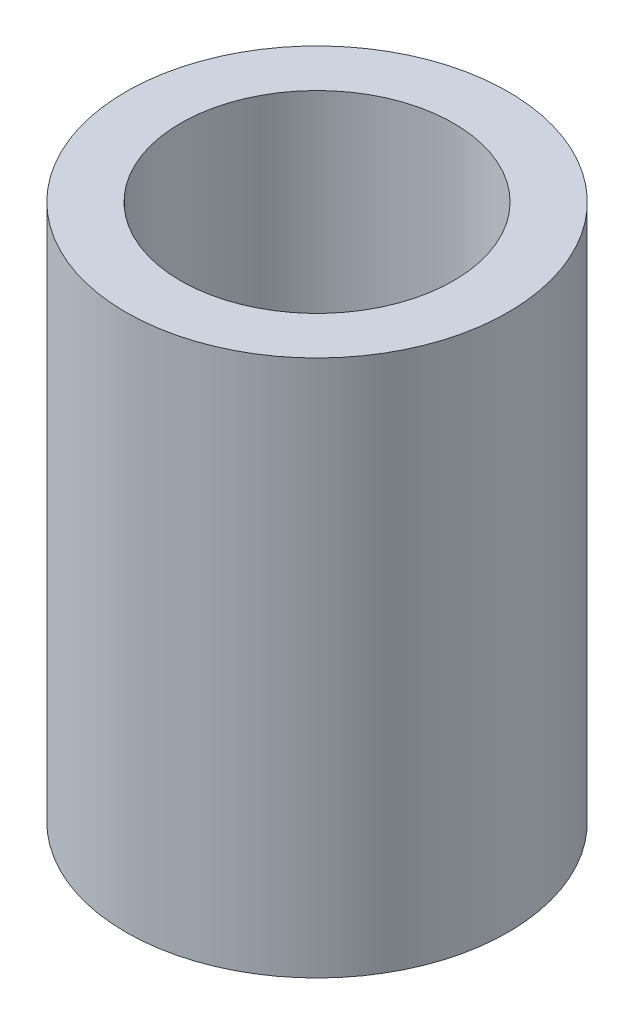
ISO-10303-21;
HEADER;
FILE_DESCRIPTION(('STEP AP214'),'2;1');
FILE_NAME('part.step','',(''),(''),'','','');
FILE_SCHEMA(('AUTOMOTIVE_DESIGN { 1 0 10303 214 1 1 1 1 }'));
ENDSEC;
DATA;
#1=APPLICATION_CONTEXT('core data for automotive mechanical design processes');
#2=APPLICATION_PROTOCOL_DEFINITION('international standard','automotive_design',2000,#1);
#3=PRODUCT_CONTEXT('',#1,'mechanical');
#4=PRODUCT('Part','Part','',(#3));
#5=PRODUCT_RELATED_PRODUCT_CATEGORY('part','',(#4));
#6=PRODUCT_DEFINITION_FORMATION('','',#4);
#7=PRODUCT_DEFINITION_CONTEXT('part definition',#1,'design');
#8=PRODUCT_DEFINITION('design','',#6,#7);
#9=PRODUCT_DEFINITION_SHAPE('','',#8);
#10=(LENGTH_UNIT() NAMED_UNIT(*) SI_UNIT(.MILLI.,.METRE.));
#11=(NAMED_UNIT(*) PLANE_ANGLE_UNIT() SI_UNIT($,.RADIAN.));
#12=(NAMED_UNIT(*) SI_UNIT($,.STERADIAN.) SOLID_ANGLE_UNIT());
#13=UNCERTAINTY_MEASURE_WITH_UNIT(LENGTH_MEASURE(1.E-05),#10,'distance_accuracy_value','');
#14=(GEOMETRIC_REPRESENTATION_CONTEXT(3) GLOBAL_UNCERTAINTY_ASSIGNED_CONTEXT((#13)) GLOBAL_UNIT_ASSIGNED_CONTEXT((#10,
#11,#12)) REPRESENTATION_CONTEXT('',''));
#15=CARTESIAN_POINT('',(0.,0.,0.));
#16=DIRECTION('',(0.,0.,1.));
#17=DIRECTION('',(1.,0.,0.));
#18=AXIS2_PLACEMENT_3D('',#15,#16,#17);
#19=CARTESIAN_POINT('',(0.,5.9,0.));
#20=DIRECTION('',(0.,1.,0.));
#21=DIRECTION('',(0.,0.,1.));
#22=AXIS2_PLACEMENT_3D('',#19,#20,#21);
#23=PLANE('',#22);
#24=CARTESIAN_POINT('',(0.,5.9,0.));
#25=DIRECTION('',(0.,1.,0.));
#26=DIRECTION('',(0.,0.,1.));
#27=AXIS2_PLACEMENT_3D('',#24,#25,#26);
#28=CIRCLE('',#27,2.1);
#29=CARTESIAN_POINT('',(0.,5.9,2.1));
#30=VERTEX_POINT('',#29);
#31=EDGE_CURVE('E10',#30,#30,#28,.T.);
#32=ORIENTED_EDGE('',*,*,#31,.T.);
#33=EDGE_LOOP('',(#32));
#34=FACE_BOUND('',#33,.T.);
#35=CARTESIAN_POINT('',(0.,5.9,0.));
#36=DIRECTION('',(0.,1.,0.));
#37=DIRECTION('',(0.,0.,1.));
#38=AXIS2_PLACEMENT_3D('',#35,#36,#37);
#39=CIRCLE('',#38,1.5);
#40=CARTESIAN_POINT('',(0.,5.9,1.5));
#41=VERTEX_POINT('',#40);
#42=EDGE_CURVE('E54',#41,#41,#39,.T.);
#43=ORIENTED_EDGE('',*,*,#42,.F.);
#44=EDGE_LOOP('',(#43));
#45=FACE_BOUND('',#44,.T.);
#46=ADVANCED_FACE('F41',(#34,#45),#23,.T.);
#47=CARTESIAN_POINT('',(0.,0.,0.));
#48=DIRECTION('',(0.,1.,0.));
#49=DIRECTION('',(0.,0.,1.));
#50=AXIS2_PLACEMENT_3D('',#47,#48,#49);
#51=PLANE('',#50);
#52=CARTESIAN_POINT('',(0.,0.,0.));
#53=DIRECTION('',(0.,1.,0.));
#54=DIRECTION('',(0.,0.,1.));
#55=AXIS2_PLACEMENT_3D('',#52,#53,#54);
#56=CIRCLE('',#55,2.1);
#57=CARTESIAN_POINT('',(0.,0.,2.1));
#58=VERTEX_POINT('',#57);
#59=EDGE_CURVE('E45',#58,#58,#56,.T.);
#60=ORIENTED_EDGE('',*,*,#59,.F.);
#61=EDGE_LOOP('',(#60));
#62=FACE_BOUND('',#61,.T.);
#63=CARTESIAN_POINT('',(0.,0.,0.));
#64=DIRECTION('',(0.,1.,0.));
#65=DIRECTION('',(0.,0.,1.));
#66=AXIS2_PLACEMENT_3D('',#63,#64,#65);
#67=CIRCLE('',#66,1.5);
#68=CARTESIAN_POINT('',(0.,0.,1.5));
#69=VERTEX_POINT('',#68);
#70=EDGE_CURVE('E56',#69,#69,#67,.T.);
#71=ORIENTED_EDGE('',*,*,#70,.T.);
#72=EDGE_LOOP('',(#71));
#73=FACE_BOUND('',#72,.T.);
#74=ADVANCED_FACE('F68',(#62,#73),#51,.F.);
#75=CARTESIAN_POINT('',(0.,5.9,0.));
#76=DIRECTION('',(0.,-1.,0.));
#77=DIRECTION('',(0.,0.,-1.));
#78=AXIS2_PLACEMENT_3D('',#75,#76,#77);
#79=CYLINDRICAL_SURFACE('',#78,2.1);
#80=ORIENTED_EDGE('',*,*,#31,.F.);
#81=EDGE_LOOP('',(#80));
#82=FACE_BOUND('',#81,.T.);
#83=ORIENTED_EDGE('',*,*,#59,.T.);
#84=EDGE_LOOP('',(#83));
#85=FACE_BOUND('',#84,.T.);
#86=ADVANCED_FACE('F43',(#82,#85),#79,.T.);
#87=CARTESIAN_POINT('',(0.,5.9,0.));
#88=DIRECTION('',(0.,-1.,0.));
#89=DIRECTION('',(0.,0.,-1.));
#90=AXIS2_PLACEMENT_3D('',#87,#88,#89);
#91=CYLINDRICAL_SURFACE('',#90,1.5);
#92=ORIENTED_EDGE('',*,*,#42,.T.);
#93=EDGE_LOOP('',(#92));
#94=FACE_BOUND('',#93,.T.);
#95=ORIENTED_EDGE('',*,*,#70,.F.);
#96=EDGE_LOOP('',(#95));
#97=FACE_BOUND('',#96,.T.);
#98=ADVANCED_FACE('F64',(#94,#97),#91,.F.);
#99=CLOSED_SHELL('',(#46,#74,#86,#98));
#100=MANIFOLD_SOLID_BREP('B2',#99);
#101=ADVANCED_BREP_SHAPE_REPRESENTATION('',(#18,#100),#14);
#102=SHAPE_DEFINITION_REPRESENTATION(#9,#101);
ENDSEC;
END-ISO-10303-21;
